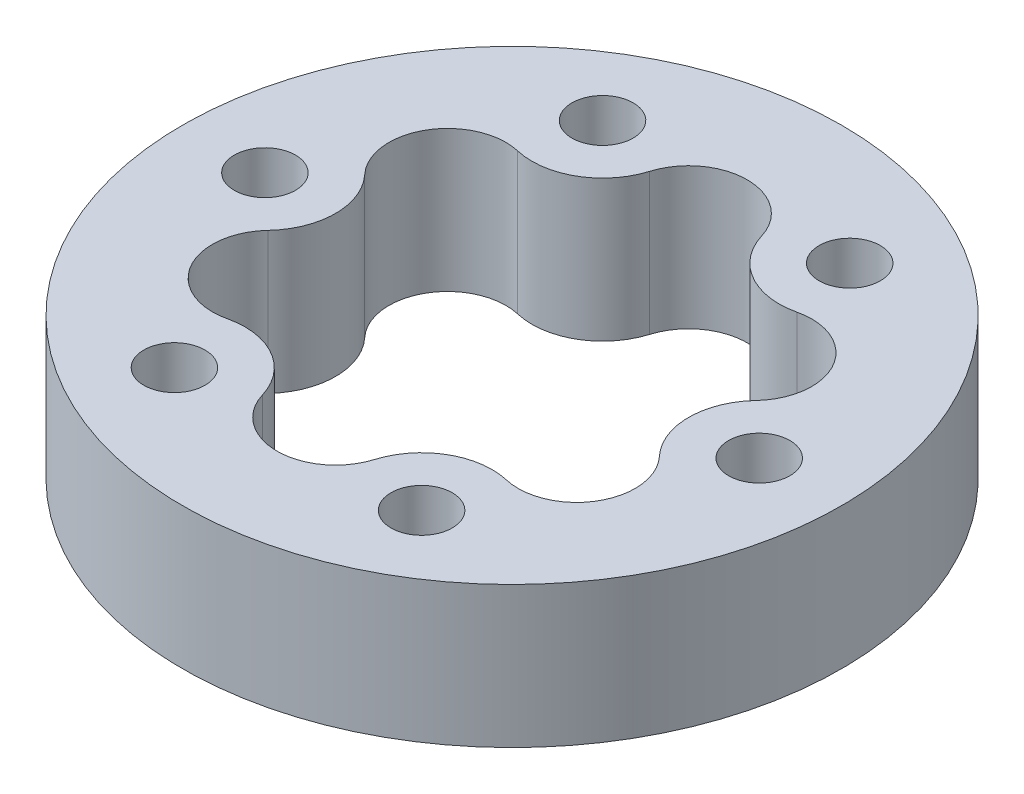
ISO-10303-21;
HEADER;
FILE_DESCRIPTION(('STEP AP214'),'2;1');
FILE_NAME('part.step','',(''),(''),'','','');
FILE_SCHEMA(('AUTOMOTIVE_DESIGN { 1 0 10303 214 1 1 1 1 }'));
ENDSEC;
DATA;
#1=APPLICATION_CONTEXT('core data for automotive mechanical design processes');
#2=APPLICATION_PROTOCOL_DEFINITION('international standard','automotive_design',2000,#1);
#3=PRODUCT_CONTEXT('',#1,'mechanical');
#4=PRODUCT('Part','Part','',(#3));
#5=PRODUCT_RELATED_PRODUCT_CATEGORY('part','',(#4));
#6=PRODUCT_DEFINITION_FORMATION('','',#4);
#7=PRODUCT_DEFINITION_CONTEXT('part definition',#1,'design');
#8=PRODUCT_DEFINITION('design','',#6,#7);
#9=PRODUCT_DEFINITION_SHAPE('','',#8);
#10=(LENGTH_UNIT() NAMED_UNIT(*) SI_UNIT(.MILLI.,.METRE.));
#11=(NAMED_UNIT(*) PLANE_ANGLE_UNIT() SI_UNIT($,.RADIAN.));
#12=(NAMED_UNIT(*) SI_UNIT($,.STERADIAN.) SOLID_ANGLE_UNIT());
#13=UNCERTAINTY_MEASURE_WITH_UNIT(LENGTH_MEASURE(1.E-05),#10,'distance_accuracy_value','');
#14=(GEOMETRIC_REPRESENTATION_CONTEXT(3) GLOBAL_UNCERTAINTY_ASSIGNED_CONTEXT((#13)) GLOBAL_UNIT_ASSIGNED_CONTEXT((#10,
#11,#12)) REPRESENTATION_CONTEXT('',''));
#15=CARTESIAN_POINT('',(0.,0.,0.));
#16=DIRECTION('',(0.,0.,1.));
#17=DIRECTION('',(1.,0.,0.));
#18=AXIS2_PLACEMENT_3D('',#15,#16,#17);
#19=CARTESIAN_POINT('',(0.,12.,0.));
#20=DIRECTION('',(0.,1.,0.));
#21=DIRECTION('',(0.,0.,-1.));
#22=AXIS2_PLACEMENT_3D('',#19,#20,#21);
#23=PLANE('',#22);
#24=CARTESIAN_POINT('',(-10.5000000000001,12.,18.1865334794733));
#25=DIRECTION('',(0.,-1.,0.));
#26=DIRECTION('',(0.,0.,-1.));
#27=AXIS2_PLACEMENT_3D('',#24,#25,#26);
#28=CIRCLE('',#27,2.6);
#29=CARTESIAN_POINT('',(-10.5000000000001,12.,15.5865334794733));
#30=VERTEX_POINT('',#29);
#31=EDGE_CURVE('E227',#30,#30,#28,.T.);
#32=ORIENTED_EDGE('',*,*,#31,.T.);
#33=EDGE_LOOP('',(#32));
#34=FACE_BOUND('',#33,.T.);
#35=CARTESIAN_POINT('',(-10.5000000000001,12.,-18.1865334794731));
#36=DIRECTION('',(0.,-1.,0.));
#37=DIRECTION('',(0.,0.,-1.));
#38=AXIS2_PLACEMENT_3D('',#35,#36,#37);
#39=CIRCLE('',#38,2.6);
#40=CARTESIAN_POINT('',(-10.5000000000001,12.,-20.7865334794731));
#41=VERTEX_POINT('',#40);
#42=EDGE_CURVE('E239',#41,#41,#39,.T.);
#43=ORIENTED_EDGE('',*,*,#42,.T.);
#44=EDGE_LOOP('',(#43));
#45=FACE_BOUND('',#44,.T.);
#46=CARTESIAN_POINT('',(20.9999999999999,12.,0.));
#47=DIRECTION('',(0.,-1.,0.));
#48=DIRECTION('',(0.,0.,-1.));
#49=AXIS2_PLACEMENT_3D('',#46,#47,#48);
#50=CIRCLE('',#49,2.6);
#51=CARTESIAN_POINT('',(20.9999999999999,12.,-2.59999999999992));
#52=VERTEX_POINT('',#51);
#53=EDGE_CURVE('E251',#52,#52,#50,.T.);
#54=ORIENTED_EDGE('',*,*,#53,.T.);
#55=EDGE_LOOP('',(#54));
#56=FACE_BOUND('',#55,.T.);
#57=CARTESIAN_POINT('',(0.,12.,0.));
#58=DIRECTION('',(0.,-1.,0.));
#59=DIRECTION('',(0.,0.,-1.));
#60=AXIS2_PLACEMENT_3D('',#57,#58,#59);
#61=CIRCLE('',#60,28.);
#62=CARTESIAN_POINT('',(0.,12.,-28.));
#63=VERTEX_POINT('',#62);
#64=EDGE_CURVE('E11',#63,#63,#61,.T.);
#65=ORIENTED_EDGE('',*,*,#64,.F.);
#66=EDGE_LOOP('',(#65));
#67=FACE_BOUND('',#66,.T.);
#68=CARTESIAN_POINT('',(10.4999999999999,12.,18.1865334794733));
#69=DIRECTION('',(0.,-1.,0.));
#70=DIRECTION('',(0.,0.,-1.));
#71=AXIS2_PLACEMENT_3D('',#68,#69,#70);
#72=CIRCLE('',#71,2.6);
#73=CARTESIAN_POINT('',(10.4999999999999,12.,15.5865334794733));
#74=VERTEX_POINT('',#73);
#75=EDGE_CURVE('E257',#74,#74,#72,.T.);
#76=ORIENTED_EDGE('',*,*,#75,.T.);
#77=EDGE_LOOP('',(#76));
#78=FACE_BOUND('',#77,.T.);
#79=CARTESIAN_POINT('',(10.4999999999999,12.,-18.1865334794731));
#80=DIRECTION('',(0.,-1.,0.));
#81=DIRECTION('',(0.,0.,-1.));
#82=AXIS2_PLACEMENT_3D('',#79,#80,#81);
#83=CIRCLE('',#82,2.6);
#84=CARTESIAN_POINT('',(10.4999999999999,12.,-20.7865334794731));
#85=VERTEX_POINT('',#84);
#86=EDGE_CURVE('E245',#85,#85,#83,.T.);
#87=ORIENTED_EDGE('',*,*,#86,.T.);
#88=EDGE_LOOP('',(#87));
#89=FACE_BOUND('',#88,.T.);
#90=CARTESIAN_POINT('',(-21.,12.,-1.2805208282618E-13));
#91=DIRECTION('',(0.,-1.,0.));
#92=DIRECTION('',(0.,0.,-1.));
#93=AXIS2_PLACEMENT_3D('',#90,#91,#92);
#94=CIRCLE('',#93,2.6);
#95=CARTESIAN_POINT('',(-21.,12.,-2.60000000000013));
#96=VERTEX_POINT('',#95);
#97=EDGE_CURVE('E233',#96,#96,#94,.T.);
#98=ORIENTED_EDGE('',*,*,#97,.T.);
#99=EDGE_LOOP('',(#98));
#100=FACE_BOUND('',#99,.T.);
#101=CARTESIAN_POINT('',(0.,12.,15.));
#102=DIRECTION('',(0.,-1.,0.));
#103=DIRECTION('',(0.,0.,-1.));
#104=AXIS2_PLACEMENT_3D('',#101,#102,#103);
#105=CIRCLE('',#104,4.97287544884227);
#106=CARTESIAN_POINT('',(4.75856966173348,12.,16.444127765859));
#107=VERTEX_POINT('',#106);
#108=CARTESIAN_POINT('',(-4.75856923533456,12.,16.4441291708941));
#109=VERTEX_POINT('',#108);
#110=EDGE_CURVE('E224',#107,#109,#105,.T.);
#111=ORIENTED_EDGE('',*,*,#110,.T.);
#112=CARTESIAN_POINT('',(-10.4999999999999,12.,18.1865334794733));
#113=DIRECTION('',(0.,-1.,0.));
#114=DIRECTION('',(0.,0.,-1.));
#115=AXIS2_PLACEMENT_3D('',#112,#113,#114);
#116=CIRCLE('',#115,6.00000000000006);
#117=CARTESIAN_POINT('',(-11.8617475574441,12.,12.3431060956691));
#118=VERTEX_POINT('',#117);
#119=EDGE_CURVE('E130',#109,#118,#116,.F.);
#120=ORIENTED_EDGE('',*,*,#119,.T.);
#121=CARTESIAN_POINT('',(-12.9903810567665,12.,7.50000000000015));
#122=DIRECTION('',(0.,-1.,0.));
#123=DIRECTION('',(0.,0.,-1.));
#124=AXIS2_PLACEMENT_3D('',#121,#122,#123);
#125=CIRCLE('',#124,4.97287544884229);
#126=CARTESIAN_POINT('',(-16.6203182227744,12.,4.10102274198029));
#127=VERTEX_POINT('',#126);
#128=EDGE_CURVE('E194',#118,#127,#125,.T.);
#129=ORIENTED_EDGE('',*,*,#128,.T.);
#130=CARTESIAN_POINT('',(-21.,12.,0.));
#131=DIRECTION('',(0.,-1.,0.));
#132=DIRECTION('',(0.,0.,-1.));
#133=AXIS2_PLACEMENT_3D('',#130,#131,#132);
#134=CIRCLE('',#133,6.00000000000005);
#135=CARTESIAN_POINT('',(-16.620317219178,12.,-4.10102167019005));
#136=VERTEX_POINT('',#135);
#137=EDGE_CURVE('E197',#127,#136,#134,.F.);
#138=ORIENTED_EDGE('',*,*,#137,.T.);
#139=CARTESIAN_POINT('',(-12.9903810567667,12.,-7.49999999999988));
#140=DIRECTION('',(0.,-1.,0.));
#141=DIRECTION('',(0.,0.,-1.));
#142=AXIS2_PLACEMENT_3D('',#139,#140,#141);
#143=CIRCLE('',#142,4.97287544884227);
#144=CARTESIAN_POINT('',(-11.8617489874398,12.,-12.3431064289139));
#145=VERTEX_POINT('',#144);
#146=EDGE_CURVE('E200',#136,#145,#143,.T.);
#147=ORIENTED_EDGE('',*,*,#146,.T.);
#148=CARTESIAN_POINT('',(-10.5,12.,-18.1865334794732));
#149=DIRECTION('',(0.,-1.,0.));
#150=DIRECTION('',(0.,0.,-1.));
#151=AXIS2_PLACEMENT_3D('',#148,#149,#150);
#152=CIRCLE('',#151,6.00000000000014);
#153=CARTESIAN_POINT('',(-4.75856966173388,12.,-16.4441277658589));
#154=VERTEX_POINT('',#153);
#155=EDGE_CURVE('E203',#145,#154,#152,.F.);
#156=ORIENTED_EDGE('',*,*,#155,.T.);
#157=CARTESIAN_POINT('',(-1.04517089427603E-13,12.,-15.));
#158=DIRECTION('',(0.,-1.,0.));
#159=DIRECTION('',(0.,0.,-1.));
#160=AXIS2_PLACEMENT_3D('',#157,#158,#159);
#161=CIRCLE('',#160,4.97287544884223);
#162=CARTESIAN_POINT('',(4.75856923533452,12.,-16.4441291708941));
#163=VERTEX_POINT('',#162);
#164=EDGE_CURVE('E206',#154,#163,#161,.T.);
#165=ORIENTED_EDGE('',*,*,#164,.T.);
#166=CARTESIAN_POINT('',(10.5,12.,-18.1865334794732));
#167=DIRECTION('',(0.,-1.,0.));
#168=DIRECTION('',(0.,0.,-1.));
#169=AXIS2_PLACEMENT_3D('',#166,#167,#168);
#170=CIRCLE('',#169,6.00000000000022);
#171=CARTESIAN_POINT('',(11.8617475574439,12.,-12.3431060956689));
#172=VERTEX_POINT('',#171);
#173=EDGE_CURVE('E209',#163,#172,#170,.F.);
#174=ORIENTED_EDGE('',*,*,#173,.T.);
#175=CARTESIAN_POINT('',(12.9903810567665,12.,-7.50000000000006));
#176=DIRECTION('',(0.,-1.,0.));
#177=DIRECTION('',(0.,0.,-1.));
#178=AXIS2_PLACEMENT_3D('',#175,#176,#177);
#179=CIRCLE('',#178,4.97287544884221);
#180=CARTESIAN_POINT('',(16.6203182227742,12.,-4.10102274198015));
#181=VERTEX_POINT('',#180);
#182=EDGE_CURVE('E212',#172,#181,#179,.T.);
#183=ORIENTED_EDGE('',*,*,#182,.T.);
#184=CARTESIAN_POINT('',(21.,12.,0.));
#185=DIRECTION('',(0.,-1.,0.));
#186=DIRECTION('',(0.,0.,-1.));
#187=AXIS2_PLACEMENT_3D('',#184,#185,#186);
#188=CIRCLE('',#187,6.00000000000022);
#189=CARTESIAN_POINT('',(16.6203172191778,12.,4.10102167019009));
#190=VERTEX_POINT('',#189);
#191=EDGE_CURVE('E215',#181,#190,#188,.F.);
#192=ORIENTED_EDGE('',*,*,#191,.T.);
#193=CARTESIAN_POINT('',(12.9903810567666,12.,7.49999999999997));
#194=DIRECTION('',(0.,-1.,0.));
#195=DIRECTION('',(0.,0.,-1.));
#196=AXIS2_PLACEMENT_3D('',#193,#194,#195);
#197=CIRCLE('',#196,4.97287544884224);
#198=CARTESIAN_POINT('',(11.8617489874396,12.,12.343106428914));
#199=VERTEX_POINT('',#198);
#200=EDGE_CURVE('E218',#190,#199,#197,.T.);
#201=ORIENTED_EDGE('',*,*,#200,.T.);
#202=CARTESIAN_POINT('',(10.4999999999999,12.,18.1865334794733));
#203=DIRECTION('',(0.,-1.,0.));
#204=DIRECTION('',(0.,0.,-1.));
#205=AXIS2_PLACEMENT_3D('',#202,#203,#204);
#206=CIRCLE('',#205,6.00000000000013);
#207=EDGE_CURVE('E221',#199,#107,#206,.F.);
#208=ORIENTED_EDGE('',*,*,#207,.T.);
#209=EDGE_LOOP('',(#111,#120,#129,#138,#147,#156,#165,#174,#183,#192,#201,#208));
#210=FACE_BOUND('',#209,.T.);
#211=ADVANCED_FACE('F36',(#34,#45,#56,#67,#78,#89,#100,#210),#23,.T.);
#212=CARTESIAN_POINT('',(0.,0.,0.));
#213=DIRECTION('',(0.,1.,0.));
#214=DIRECTION('',(0.,0.,-1.));
#215=AXIS2_PLACEMENT_3D('',#212,#213,#214);
#216=PLANE('',#215);
#217=CARTESIAN_POINT('',(0.,0.,0.));
#218=DIRECTION('',(0.,-1.,0.));
#219=DIRECTION('',(0.,0.,-1.));
#220=AXIS2_PLACEMENT_3D('',#217,#218,#219);
#221=CIRCLE('',#220,28.);
#222=CARTESIAN_POINT('',(0.,0.,-28.));
#223=VERTEX_POINT('',#222);
#224=EDGE_CURVE('E40',#223,#223,#221,.T.);
#225=ORIENTED_EDGE('',*,*,#224,.T.);
#226=EDGE_LOOP('',(#225));
#227=FACE_BOUND('',#226,.T.);
#228=CARTESIAN_POINT('',(10.4999999999999,0.,18.1865334794733));
#229=DIRECTION('',(0.,-1.,0.));
#230=DIRECTION('',(0.,0.,-1.));
#231=AXIS2_PLACEMENT_3D('',#228,#229,#230);
#232=CIRCLE('',#231,2.6);
#233=CARTESIAN_POINT('',(10.4999999999999,0.,15.5865334794733));
#234=VERTEX_POINT('',#233);
#235=EDGE_CURVE('E254',#234,#234,#232,.T.);
#236=ORIENTED_EDGE('',*,*,#235,.F.);
#237=EDGE_LOOP('',(#236));
#238=FACE_BOUND('',#237,.T.);
#239=CARTESIAN_POINT('',(20.9999999999999,0.,0.));
#240=DIRECTION('',(0.,-1.,0.));
#241=DIRECTION('',(0.,0.,-1.));
#242=AXIS2_PLACEMENT_3D('',#239,#240,#241);
#243=CIRCLE('',#242,2.6);
#244=CARTESIAN_POINT('',(20.9999999999999,0.,-2.59999999999992));
#245=VERTEX_POINT('',#244);
#246=EDGE_CURVE('E248',#245,#245,#243,.T.);
#247=ORIENTED_EDGE('',*,*,#246,.F.);
#248=EDGE_LOOP('',(#247));
#249=FACE_BOUND('',#248,.T.);
#250=CARTESIAN_POINT('',(10.4999999999999,0.,-18.1865334794731));
#251=DIRECTION('',(0.,-1.,0.));
#252=DIRECTION('',(0.,0.,-1.));
#253=AXIS2_PLACEMENT_3D('',#250,#251,#252);
#254=CIRCLE('',#253,2.6);
#255=CARTESIAN_POINT('',(10.4999999999999,0.,-20.7865334794731));
#256=VERTEX_POINT('',#255);
#257=EDGE_CURVE('E242',#256,#256,#254,.T.);
#258=ORIENTED_EDGE('',*,*,#257,.F.);
#259=EDGE_LOOP('',(#258));
#260=FACE_BOUND('',#259,.T.);
#261=CARTESIAN_POINT('',(-10.5000000000001,0.,-18.1865334794731));
#262=DIRECTION('',(0.,-1.,0.));
#263=DIRECTION('',(0.,0.,-1.));
#264=AXIS2_PLACEMENT_3D('',#261,#262,#263);
#265=CIRCLE('',#264,2.6);
#266=CARTESIAN_POINT('',(-10.5000000000001,0.,-20.7865334794731));
#267=VERTEX_POINT('',#266);
#268=EDGE_CURVE('E236',#267,#267,#265,.T.);
#269=ORIENTED_EDGE('',*,*,#268,.F.);
#270=EDGE_LOOP('',(#269));
#271=FACE_BOUND('',#270,.T.);
#272=CARTESIAN_POINT('',(-21.,0.,-1.2805208282618E-13));
#273=DIRECTION('',(0.,-1.,0.));
#274=DIRECTION('',(0.,0.,-1.));
#275=AXIS2_PLACEMENT_3D('',#272,#273,#274);
#276=CIRCLE('',#275,2.6);
#277=CARTESIAN_POINT('',(-21.,0.,-2.60000000000013));
#278=VERTEX_POINT('',#277);
#279=EDGE_CURVE('E230',#278,#278,#276,.T.);
#280=ORIENTED_EDGE('',*,*,#279,.F.);
#281=EDGE_LOOP('',(#280));
#282=FACE_BOUND('',#281,.T.);
#283=CARTESIAN_POINT('',(-10.5000000000001,0.,18.1865334794733));
#284=DIRECTION('',(0.,-1.,0.));
#285=DIRECTION('',(0.,0.,-1.));
#286=AXIS2_PLACEMENT_3D('',#283,#284,#285);
#287=CIRCLE('',#286,2.6);
#288=CARTESIAN_POINT('',(-10.5000000000001,0.,15.5865334794733));
#289=VERTEX_POINT('',#288);
#290=EDGE_CURVE('E226',#289,#289,#287,.T.);
#291=ORIENTED_EDGE('',*,*,#290,.F.);
#292=EDGE_LOOP('',(#291));
#293=FACE_BOUND('',#292,.T.);
#294=CARTESIAN_POINT('',(10.4999999999999,0.,18.1865334794733));
#295=DIRECTION('',(0.,1.,0.));
#296=DIRECTION('',(0.,0.,-1.));
#297=AXIS2_PLACEMENT_3D('',#294,#295,#296);
#298=CIRCLE('',#297,6.00000000000013);
#299=CARTESIAN_POINT('',(11.8617489874396,0.,12.343106428914));
#300=VERTEX_POINT('',#299);
#301=CARTESIAN_POINT('',(4.75856966173348,0.,16.444127765859));
#302=VERTEX_POINT('',#301);
#303=EDGE_CURVE('E132',#300,#302,#298,.T.);
#304=ORIENTED_EDGE('',*,*,#303,.F.);
#305=CARTESIAN_POINT('',(12.9903810567666,0.,7.49999999999997));
#306=DIRECTION('',(0.,-1.,0.));
#307=DIRECTION('',(0.,0.,1.));
#308=AXIS2_PLACEMENT_3D('',#305,#306,#307);
#309=CIRCLE('',#308,4.97287544884224);
#310=CARTESIAN_POINT('',(16.6203172191778,0.,4.10102167019009));
#311=VERTEX_POINT('',#310);
#312=EDGE_CURVE('E169',#311,#300,#309,.T.);
#313=ORIENTED_EDGE('',*,*,#312,.F.);
#314=CARTESIAN_POINT('',(21.,0.,0.));
#315=DIRECTION('',(0.,1.,0.));
#316=DIRECTION('',(0.,0.,-1.));
#317=AXIS2_PLACEMENT_3D('',#314,#315,#316);
#318=CIRCLE('',#317,6.00000000000022);
#319=CARTESIAN_POINT('',(16.6203182227742,0.,-4.10102274198015));
#320=VERTEX_POINT('',#319);
#321=EDGE_CURVE('E166',#320,#311,#318,.T.);
#322=ORIENTED_EDGE('',*,*,#321,.F.);
#323=CARTESIAN_POINT('',(12.9903810567665,0.,-7.50000000000006));
#324=DIRECTION('',(0.,-1.,0.));
#325=DIRECTION('',(0.,0.,1.));
#326=AXIS2_PLACEMENT_3D('',#323,#324,#325);
#327=CIRCLE('',#326,4.97287544884221);
#328=CARTESIAN_POINT('',(11.8617475574439,0.,-12.3431060956689));
#329=VERTEX_POINT('',#328);
#330=EDGE_CURVE('E163',#329,#320,#327,.T.);
#331=ORIENTED_EDGE('',*,*,#330,.F.);
#332=CARTESIAN_POINT('',(10.5,0.,-18.1865334794732));
#333=DIRECTION('',(0.,1.,0.));
#334=DIRECTION('',(0.,0.,-1.));
#335=AXIS2_PLACEMENT_3D('',#332,#333,#334);
#336=CIRCLE('',#335,6.00000000000022);
#337=CARTESIAN_POINT('',(4.75856923533452,0.,-16.4441291708941));
#338=VERTEX_POINT('',#337);
#339=EDGE_CURVE('E160',#338,#329,#336,.T.);
#340=ORIENTED_EDGE('',*,*,#339,.F.);
#341=CARTESIAN_POINT('',(-1.04517089427603E-13,0.,-15.));
#342=DIRECTION('',(0.,-1.,0.));
#343=DIRECTION('',(0.,0.,1.));
#344=AXIS2_PLACEMENT_3D('',#341,#342,#343);
#345=CIRCLE('',#344,4.97287544884223);
#346=CARTESIAN_POINT('',(-4.75856966173388,0.,-16.4441277658589));
#347=VERTEX_POINT('',#346);
#348=EDGE_CURVE('E157',#347,#338,#345,.T.);
#349=ORIENTED_EDGE('',*,*,#348,.F.);
#350=CARTESIAN_POINT('',(-10.5,0.,-18.1865334794732));
#351=DIRECTION('',(0.,1.,0.));
#352=DIRECTION('',(0.,0.,-1.));
#353=AXIS2_PLACEMENT_3D('',#350,#351,#352);
#354=CIRCLE('',#353,6.00000000000014);
#355=CARTESIAN_POINT('',(-11.8617489874398,0.,-12.3431064289139));
#356=VERTEX_POINT('',#355);
#357=EDGE_CURVE('E154',#356,#347,#354,.T.);
#358=ORIENTED_EDGE('',*,*,#357,.F.);
#359=CARTESIAN_POINT('',(-12.9903810567667,0.,-7.49999999999988));
#360=DIRECTION('',(0.,-1.,0.));
#361=DIRECTION('',(0.,0.,1.));
#362=AXIS2_PLACEMENT_3D('',#359,#360,#361);
#363=CIRCLE('',#362,4.97287544884227);
#364=CARTESIAN_POINT('',(-16.620317219178,0.,-4.10102167019005));
#365=VERTEX_POINT('',#364);
#366=EDGE_CURVE('E151',#365,#356,#363,.T.);
#367=ORIENTED_EDGE('',*,*,#366,.F.);
#368=CARTESIAN_POINT('',(-21.,0.,0.));
#369=DIRECTION('',(0.,1.,0.));
#370=DIRECTION('',(0.,0.,-1.));
#371=AXIS2_PLACEMENT_3D('',#368,#369,#370);
#372=CIRCLE('',#371,6.00000000000005);
#373=CARTESIAN_POINT('',(-16.6203182227744,0.,4.10102274198029));
#374=VERTEX_POINT('',#373);
#375=EDGE_CURVE('E146',#374,#365,#372,.T.);
#376=ORIENTED_EDGE('',*,*,#375,.F.);
#377=CARTESIAN_POINT('',(-12.9903810567665,0.,7.50000000000015));
#378=DIRECTION('',(0.,-1.,0.));
#379=DIRECTION('',(0.,0.,1.));
#380=AXIS2_PLACEMENT_3D('',#377,#378,#379);
#381=CIRCLE('',#380,4.97287544884229);
#382=CARTESIAN_POINT('',(-11.8617475574442,0.,12.3431060956689));
#383=VERTEX_POINT('',#382);
#384=EDGE_CURVE('E144',#383,#374,#381,.T.);
#385=ORIENTED_EDGE('',*,*,#384,.F.);
#386=CARTESIAN_POINT('',(-10.4999999999999,0.,18.1865334794733));
#387=DIRECTION('',(0.,1.,0.));
#388=DIRECTION('',(0.,0.,-1.));
#389=AXIS2_PLACEMENT_3D('',#386,#387,#388);
#390=CIRCLE('',#389,6.00000000000006);
#391=CARTESIAN_POINT('',(-4.75856923533456,0.,16.4441291708941));
#392=VERTEX_POINT('',#391);
#393=EDGE_CURVE('E127',#392,#383,#390,.T.);
#394=ORIENTED_EDGE('',*,*,#393,.F.);
#395=CARTESIAN_POINT('',(0.,0.,15.));
#396=DIRECTION('',(0.,-1.,0.));
#397=DIRECTION('',(0.,0.,1.));
#398=AXIS2_PLACEMENT_3D('',#395,#396,#397);
#399=CIRCLE('',#398,4.97287544884227);
#400=EDGE_CURVE('E135',#302,#392,#399,.T.);
#401=ORIENTED_EDGE('',*,*,#400,.F.);
#402=EDGE_LOOP('',(#304,#313,#322,#331,#340,#349,#358,#367,#376,#385,#394,#401));
#403=FACE_BOUND('',#402,.T.);
#404=ADVANCED_FACE('F142',(#227,#238,#249,#260,#271,#282,#293,#403),#216,.F.);
#405=CARTESIAN_POINT('',(0.,12.,0.));
#406=DIRECTION('',(0.,-1.,0.));
#407=DIRECTION('',(0.,0.,1.));
#408=AXIS2_PLACEMENT_3D('',#405,#406,#407);
#409=CYLINDRICAL_SURFACE('',#408,28.);
#410=ORIENTED_EDGE('',*,*,#64,.T.);
#411=EDGE_LOOP('',(#410));
#412=FACE_BOUND('',#411,.T.);
#413=ORIENTED_EDGE('',*,*,#224,.F.);
#414=EDGE_LOOP('',(#413));
#415=FACE_BOUND('',#414,.T.);
#416=ADVANCED_FACE('F38',(#412,#415),#409,.T.);
#417=CARTESIAN_POINT('',(10.4999999999999,12.,18.1865334794733));
#418=DIRECTION('',(0.,-1.,0.));
#419=DIRECTION('',(0.,0.,1.));
#420=AXIS2_PLACEMENT_3D('',#417,#418,#419);
#421=CYLINDRICAL_SURFACE('',#420,2.6);
#422=ORIENTED_EDGE('',*,*,#75,.F.);
#423=EDGE_LOOP('',(#422));
#424=FACE_BOUND('',#423,.T.);
#425=ORIENTED_EDGE('',*,*,#235,.T.);
#426=EDGE_LOOP('',(#425));
#427=FACE_BOUND('',#426,.T.);
#428=ADVANCED_FACE('F263',(#424,#427),#421,.F.);
#429=CARTESIAN_POINT('',(20.9999999999999,12.,0.));
#430=DIRECTION('',(0.,-1.,0.));
#431=DIRECTION('',(0.,0.,1.));
#432=AXIS2_PLACEMENT_3D('',#429,#430,#431);
#433=CYLINDRICAL_SURFACE('',#432,2.6);
#434=ORIENTED_EDGE('',*,*,#53,.F.);
#435=EDGE_LOOP('',(#434));
#436=FACE_BOUND('',#435,.T.);
#437=ORIENTED_EDGE('',*,*,#246,.T.);
#438=EDGE_LOOP('',(#437));
#439=FACE_BOUND('',#438,.T.);
#440=ADVANCED_FACE('F302',(#436,#439),#433,.F.);
#441=CARTESIAN_POINT('',(10.4999999999999,12.,-18.1865334794731));
#442=DIRECTION('',(0.,-1.,0.));
#443=DIRECTION('',(0.,0.,1.));
#444=AXIS2_PLACEMENT_3D('',#441,#442,#443);
#445=CYLINDRICAL_SURFACE('',#444,2.6);
#446=ORIENTED_EDGE('',*,*,#86,.F.);
#447=EDGE_LOOP('',(#446));
#448=FACE_BOUND('',#447,.T.);
#449=ORIENTED_EDGE('',*,*,#257,.T.);
#450=EDGE_LOOP('',(#449));
#451=FACE_BOUND('',#450,.T.);
#452=ADVANCED_FACE('F306',(#448,#451),#445,.F.);
#453=CARTESIAN_POINT('',(-10.5000000000001,12.,-18.1865334794731));
#454=DIRECTION('',(0.,-1.,0.));
#455=DIRECTION('',(0.,0.,1.));
#456=AXIS2_PLACEMENT_3D('',#453,#454,#455);
#457=CYLINDRICAL_SURFACE('',#456,2.6);
#458=ORIENTED_EDGE('',*,*,#42,.F.);
#459=EDGE_LOOP('',(#458));
#460=FACE_BOUND('',#459,.T.);
#461=ORIENTED_EDGE('',*,*,#268,.T.);
#462=EDGE_LOOP('',(#461));
#463=FACE_BOUND('',#462,.T.);
#464=ADVANCED_FACE('F289',(#460,#463),#457,.F.);
#465=CARTESIAN_POINT('',(-21.,12.,-1.2805208282618E-13));
#466=DIRECTION('',(0.,-1.,0.));
#467=DIRECTION('',(0.,0.,1.));
#468=AXIS2_PLACEMENT_3D('',#465,#466,#467);
#469=CYLINDRICAL_SURFACE('',#468,2.6);
#470=ORIENTED_EDGE('',*,*,#97,.F.);
#471=EDGE_LOOP('',(#470));
#472=FACE_BOUND('',#471,.T.);
#473=ORIENTED_EDGE('',*,*,#279,.T.);
#474=EDGE_LOOP('',(#473));
#475=FACE_BOUND('',#474,.T.);
#476=ADVANCED_FACE('F280',(#472,#475),#469,.F.);
#477=CARTESIAN_POINT('',(-10.5000000000001,12.,18.1865334794733));
#478=DIRECTION('',(0.,-1.,0.));
#479=DIRECTION('',(0.,0.,1.));
#480=AXIS2_PLACEMENT_3D('',#477,#478,#479);
#481=CYLINDRICAL_SURFACE('',#480,2.6);
#482=ORIENTED_EDGE('',*,*,#31,.F.);
#483=EDGE_LOOP('',(#482));
#484=FACE_BOUND('',#483,.T.);
#485=ORIENTED_EDGE('',*,*,#290,.T.);
#486=EDGE_LOOP('',(#485));
#487=FACE_BOUND('',#486,.T.);
#488=ADVANCED_FACE('F278',(#484,#487),#481,.F.);
#489=CARTESIAN_POINT('',(0.,0.,15.));
#490=DIRECTION('',(0.,1.,0.));
#491=DIRECTION('',(0.,0.,-1.));
#492=AXIS2_PLACEMENT_3D('',#489,#490,#491);
#493=CYLINDRICAL_SURFACE('',#492,4.97287544884227);
#494=ORIENTED_EDGE('',*,*,#110,.F.);
#495=DIRECTION('',(0.,1.,0.));
#496=VECTOR('',#495,1.);
#497=CARTESIAN_POINT('',(4.75856966173348,0.,16.444127765859));
#498=LINE('',#497,#496);
#499=EDGE_CURVE('E137',#302,#107,#498,.T.);
#500=ORIENTED_EDGE('',*,*,#499,.F.);
#501=ORIENTED_EDGE('',*,*,#400,.T.);
#502=DIRECTION('',(0.,1.,0.));
#503=VECTOR('',#502,1.);
#504=CARTESIAN_POINT('',(-4.75856923533456,0.,16.4441291708941));
#505=LINE('',#504,#503);
#506=EDGE_CURVE('E51',#392,#109,#505,.T.);
#507=ORIENTED_EDGE('',*,*,#506,.T.);
#508=EDGE_LOOP('',(#494,#500,#501,#507));
#509=FACE_BOUND('',#508,.T.);
#510=ADVANCED_FACE('F136',(#509),#493,.F.);
#511=CARTESIAN_POINT('',(10.4999999999999,0.,18.1865334794733));
#512=DIRECTION('',(0.,1.,0.));
#513=DIRECTION('',(0.,0.,-1.));
#514=AXIS2_PLACEMENT_3D('',#511,#512,#513);
#515=CYLINDRICAL_SURFACE('',#514,6.00000000000013);
#516=ORIENTED_EDGE('',*,*,#207,.F.);
#517=DIRECTION('',(0.,1.,0.));
#518=VECTOR('',#517,1.);
#519=CARTESIAN_POINT('',(11.8617489874396,0.,12.343106428914));
#520=LINE('',#519,#518);
#521=EDGE_CURVE('E174',#300,#199,#520,.T.);
#522=ORIENTED_EDGE('',*,*,#521,.F.);
#523=ORIENTED_EDGE('',*,*,#303,.T.);
#524=ORIENTED_EDGE('',*,*,#499,.T.);
#525=EDGE_LOOP('',(#516,#522,#523,#524));
#526=FACE_BOUND('',#525,.T.);
#527=ADVANCED_FACE('F287',(#526),#515,.T.);
#528=CARTESIAN_POINT('',(12.9903810567666,0.,7.49999999999997));
#529=DIRECTION('',(0.,1.,0.));
#530=DIRECTION('',(0.,0.,-1.));
#531=AXIS2_PLACEMENT_3D('',#528,#529,#530);
#532=CYLINDRICAL_SURFACE('',#531,4.97287544884224);
#533=ORIENTED_EDGE('',*,*,#200,.F.);
#534=DIRECTION('',(0.,1.,0.));
#535=VECTOR('',#534,1.);
#536=CARTESIAN_POINT('',(16.6203172191778,0.,4.10102167019009));
#537=LINE('',#536,#535);
#538=EDGE_CURVE('E176',#311,#190,#537,.T.);
#539=ORIENTED_EDGE('',*,*,#538,.F.);
#540=ORIENTED_EDGE('',*,*,#312,.T.);
#541=ORIENTED_EDGE('',*,*,#521,.T.);
#542=EDGE_LOOP('',(#533,#539,#540,#541));
#543=FACE_BOUND('',#542,.T.);
#544=ADVANCED_FACE('F335',(#543),#532,.F.);
#545=CARTESIAN_POINT('',(21.,0.,0.));
#546=DIRECTION('',(0.,1.,0.));
#547=DIRECTION('',(0.,0.,-1.));
#548=AXIS2_PLACEMENT_3D('',#545,#546,#547);
#549=CYLINDRICAL_SURFACE('',#548,6.00000000000022);
#550=ORIENTED_EDGE('',*,*,#191,.F.);
#551=DIRECTION('',(0.,1.,0.));
#552=VECTOR('',#551,1.);
#553=CARTESIAN_POINT('',(16.6203182227742,0.,-4.10102274198015));
#554=LINE('',#553,#552);
#555=EDGE_CURVE('E178',#320,#181,#554,.T.);
#556=ORIENTED_EDGE('',*,*,#555,.F.);
#557=ORIENTED_EDGE('',*,*,#321,.T.);
#558=ORIENTED_EDGE('',*,*,#538,.T.);
#559=EDGE_LOOP('',(#550,#556,#557,#558));
#560=FACE_BOUND('',#559,.T.);
#561=ADVANCED_FACE('F338',(#560),#549,.T.);
#562=CARTESIAN_POINT('',(12.9903810567665,0.,-7.50000000000006));
#563=DIRECTION('',(0.,1.,0.));
#564=DIRECTION('',(0.,0.,-1.));
#565=AXIS2_PLACEMENT_3D('',#562,#563,#564);
#566=CYLINDRICAL_SURFACE('',#565,4.97287544884221);
#567=ORIENTED_EDGE('',*,*,#182,.F.);
#568=DIRECTION('',(0.,1.,0.));
#569=VECTOR('',#568,1.);
#570=CARTESIAN_POINT('',(11.8617475574439,0.,-12.3431060956689));
#571=LINE('',#570,#569);
#572=EDGE_CURVE('E180',#329,#172,#571,.T.);
#573=ORIENTED_EDGE('',*,*,#572,.F.);
#574=ORIENTED_EDGE('',*,*,#330,.T.);
#575=ORIENTED_EDGE('',*,*,#555,.T.);
#576=EDGE_LOOP('',(#567,#573,#574,#575));
#577=FACE_BOUND('',#576,.T.);
#578=ADVANCED_FACE('F341',(#577),#566,.F.);
#579=CARTESIAN_POINT('',(10.5,0.,-18.1865334794732));
#580=DIRECTION('',(0.,1.,0.));
#581=DIRECTION('',(0.,0.,-1.));
#582=AXIS2_PLACEMENT_3D('',#579,#580,#581);
#583=CYLINDRICAL_SURFACE('',#582,6.00000000000022);
#584=ORIENTED_EDGE('',*,*,#173,.F.);
#585=DIRECTION('',(0.,1.,0.));
#586=VECTOR('',#585,1.);
#587=CARTESIAN_POINT('',(4.75856923533452,0.,-16.4441291708941));
#588=LINE('',#587,#586);
#589=EDGE_CURVE('E182',#338,#163,#588,.T.);
#590=ORIENTED_EDGE('',*,*,#589,.F.);
#591=ORIENTED_EDGE('',*,*,#339,.T.);
#592=ORIENTED_EDGE('',*,*,#572,.T.);
#593=EDGE_LOOP('',(#584,#590,#591,#592));
#594=FACE_BOUND('',#593,.T.);
#595=ADVANCED_FACE('F347',(#594),#583,.T.);
#596=CARTESIAN_POINT('',(-1.04517089427603E-13,0.,-15.));
#597=DIRECTION('',(0.,1.,0.));
#598=DIRECTION('',(0.,0.,-1.));
#599=AXIS2_PLACEMENT_3D('',#596,#597,#598);
#600=CYLINDRICAL_SURFACE('',#599,4.97287544884223);
#601=ORIENTED_EDGE('',*,*,#164,.F.);
#602=DIRECTION('',(0.,1.,0.));
#603=VECTOR('',#602,1.);
#604=CARTESIAN_POINT('',(-4.75856966173388,0.,-16.4441277658589));
#605=LINE('',#604,#603);
#606=EDGE_CURVE('E184',#347,#154,#605,.T.);
#607=ORIENTED_EDGE('',*,*,#606,.F.);
#608=ORIENTED_EDGE('',*,*,#348,.T.);
#609=ORIENTED_EDGE('',*,*,#589,.T.);
#610=EDGE_LOOP('',(#601,#607,#608,#609));
#611=FACE_BOUND('',#610,.T.);
#612=ADVANCED_FACE('F350',(#611),#600,.F.);
#613=CARTESIAN_POINT('',(-10.5,0.,-18.1865334794732));
#614=DIRECTION('',(0.,1.,0.));
#615=DIRECTION('',(0.,0.,-1.));
#616=AXIS2_PLACEMENT_3D('',#613,#614,#615);
#617=CYLINDRICAL_SURFACE('',#616,6.00000000000014);
#618=ORIENTED_EDGE('',*,*,#155,.F.);
#619=DIRECTION('',(0.,1.,0.));
#620=VECTOR('',#619,1.);
#621=CARTESIAN_POINT('',(-11.8617489874398,0.,-12.3431064289139));
#622=LINE('',#621,#620);
#623=EDGE_CURVE('E186',#356,#145,#622,.T.);
#624=ORIENTED_EDGE('',*,*,#623,.F.);
#625=ORIENTED_EDGE('',*,*,#357,.T.);
#626=ORIENTED_EDGE('',*,*,#606,.T.);
#627=EDGE_LOOP('',(#618,#624,#625,#626));
#628=FACE_BOUND('',#627,.T.);
#629=ADVANCED_FACE('F353',(#628),#617,.T.);
#630=CARTESIAN_POINT('',(-12.9903810567667,0.,-7.49999999999988));
#631=DIRECTION('',(0.,1.,0.));
#632=DIRECTION('',(0.,0.,-1.));
#633=AXIS2_PLACEMENT_3D('',#630,#631,#632);
#634=CYLINDRICAL_SURFACE('',#633,4.97287544884227);
#635=ORIENTED_EDGE('',*,*,#146,.F.);
#636=DIRECTION('',(0.,1.,0.));
#637=VECTOR('',#636,1.);
#638=CARTESIAN_POINT('',(-16.620317219178,0.,-4.10102167019005));
#639=LINE('',#638,#637);
#640=EDGE_CURVE('E188',#365,#136,#639,.T.);
#641=ORIENTED_EDGE('',*,*,#640,.F.);
#642=ORIENTED_EDGE('',*,*,#366,.T.);
#643=ORIENTED_EDGE('',*,*,#623,.T.);
#644=EDGE_LOOP('',(#635,#641,#642,#643));
#645=FACE_BOUND('',#644,.T.);
#646=ADVANCED_FACE('F357',(#645),#634,.F.);
#647=CARTESIAN_POINT('',(-21.,0.,0.));
#648=DIRECTION('',(0.,1.,0.));
#649=DIRECTION('',(0.,0.,-1.));
#650=AXIS2_PLACEMENT_3D('',#647,#648,#649);
#651=CYLINDRICAL_SURFACE('',#650,6.00000000000005);
#652=ORIENTED_EDGE('',*,*,#137,.F.);
#653=DIRECTION('',(0.,1.,0.));
#654=VECTOR('',#653,1.);
#655=CARTESIAN_POINT('',(-16.6203182227744,0.,4.10102274198029));
#656=LINE('',#655,#654);
#657=EDGE_CURVE('E190',#374,#127,#656,.T.);
#658=ORIENTED_EDGE('',*,*,#657,.F.);
#659=ORIENTED_EDGE('',*,*,#375,.T.);
#660=ORIENTED_EDGE('',*,*,#640,.T.);
#661=EDGE_LOOP('',(#652,#658,#659,#660));
#662=FACE_BOUND('',#661,.T.);
#663=ADVANCED_FACE('F360',(#662),#651,.T.);
#664=CARTESIAN_POINT('',(-12.9903810567665,0.,7.50000000000015));
#665=DIRECTION('',(0.,1.,0.));
#666=DIRECTION('',(0.,0.,-1.));
#667=AXIS2_PLACEMENT_3D('',#664,#665,#666);
#668=CYLINDRICAL_SURFACE('',#667,4.97287544884229);
#669=ORIENTED_EDGE('',*,*,#128,.F.);
#670=DIRECTION('',(0.,1.,0.));
#671=VECTOR('',#670,1.);
#672=CARTESIAN_POINT('',(-11.8617475574441,0.,12.3431060956691));
#673=LINE('',#672,#671);
#674=EDGE_CURVE('E59',#383,#118,#673,.T.);
#675=ORIENTED_EDGE('',*,*,#674,.F.);
#676=ORIENTED_EDGE('',*,*,#384,.T.);
#677=ORIENTED_EDGE('',*,*,#657,.T.);
#678=EDGE_LOOP('',(#669,#675,#676,#677));
#679=FACE_BOUND('',#678,.T.);
#680=ADVANCED_FACE('F361',(#679),#668,.F.);
#681=CARTESIAN_POINT('',(-10.4999999999999,0.,18.1865334794733));
#682=DIRECTION('',(0.,1.,0.));
#683=DIRECTION('',(0.,0.,-1.));
#684=AXIS2_PLACEMENT_3D('',#681,#682,#683);
#685=CYLINDRICAL_SURFACE('',#684,6.00000000000006);
#686=ORIENTED_EDGE('',*,*,#119,.F.);
#687=ORIENTED_EDGE('',*,*,#506,.F.);
#688=ORIENTED_EDGE('',*,*,#393,.T.);
#689=ORIENTED_EDGE('',*,*,#674,.T.);
#690=EDGE_LOOP('',(#686,#687,#688,#689));
#691=FACE_BOUND('',#690,.T.);
#692=ADVANCED_FACE('F125',(#691),#685,.T.);
#693=CLOSED_SHELL('',(#211,#404,#416,#428,#440,#452,#464,#476,#488,#510,#527,#544,#561,#578,
#595,#612,#629,#646,#663,#680,#692));
#694=MANIFOLD_SOLID_BREP('B2',#693);
#695=ADVANCED_BREP_SHAPE_REPRESENTATION('',(#18,#694),#14);
#696=SHAPE_DEFINITION_REPRESENTATION(#9,#695);
ENDSEC;
END-ISO-10303-21;
